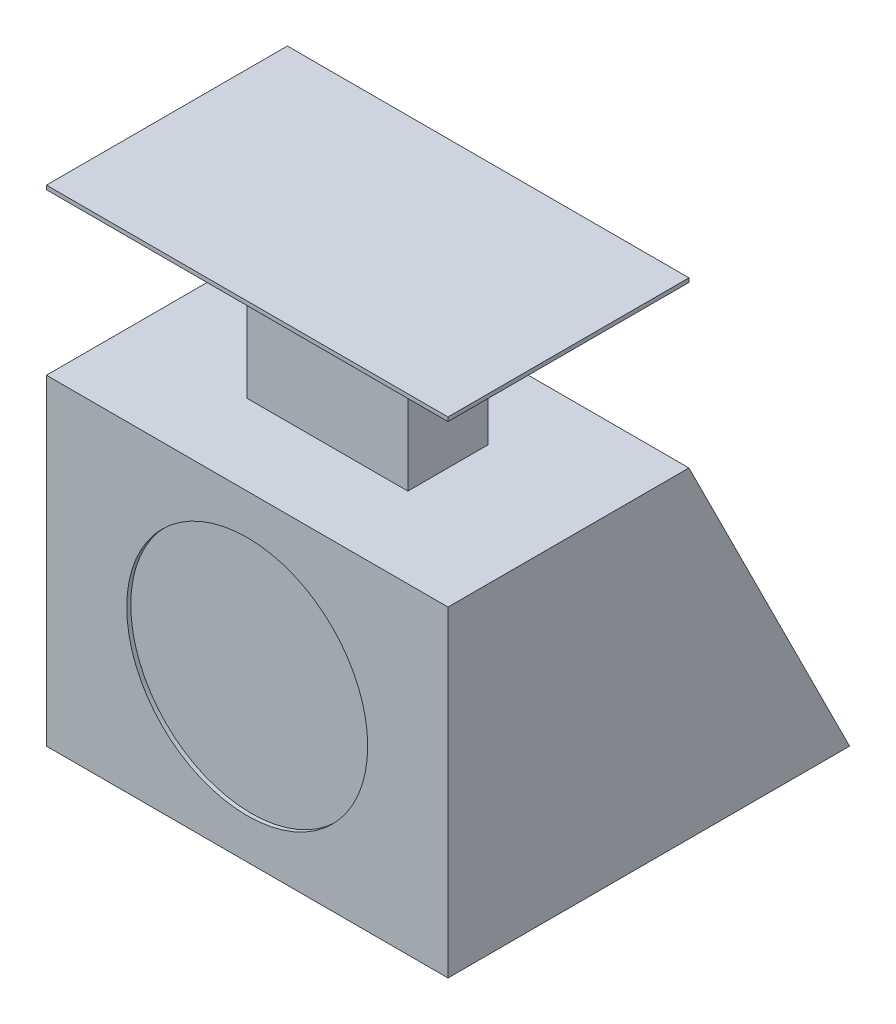
ISO-10303-21;
HEADER;
FILE_DESCRIPTION(('STEP AP214'),'2;1');
FILE_NAME('part.step','',(''),(''),'','','');
FILE_SCHEMA(('AUTOMOTIVE_DESIGN { 1 0 10303 214 1 1 1 1 }'));
ENDSEC;
DATA;
#1=APPLICATION_CONTEXT('core data for automotive mechanical design processes');
#2=APPLICATION_PROTOCOL_DEFINITION('international standard','automotive_design',2000,#1);
#3=PRODUCT_CONTEXT('',#1,'mechanical');
#4=PRODUCT('Part','Part','',(#3));
#5=PRODUCT_RELATED_PRODUCT_CATEGORY('part','',(#4));
#6=PRODUCT_DEFINITION_FORMATION('','',#4);
#7=PRODUCT_DEFINITION_CONTEXT('part definition',#1,'design');
#8=PRODUCT_DEFINITION('design','',#6,#7);
#9=PRODUCT_DEFINITION_SHAPE('','',#8);
#10=(LENGTH_UNIT() NAMED_UNIT(*) SI_UNIT(.MILLI.,.METRE.));
#11=(NAMED_UNIT(*) PLANE_ANGLE_UNIT() SI_UNIT($,.RADIAN.));
#12=(NAMED_UNIT(*) SI_UNIT($,.STERADIAN.) SOLID_ANGLE_UNIT());
#13=UNCERTAINTY_MEASURE_WITH_UNIT(LENGTH_MEASURE(1.E-05),#10,'distance_accuracy_value','');
#14=(GEOMETRIC_REPRESENTATION_CONTEXT(3) GLOBAL_UNCERTAINTY_ASSIGNED_CONTEXT((#13)) GLOBAL_UNIT_ASSIGNED_CONTEXT((#10,
#11,#12)) REPRESENTATION_CONTEXT('',''));
#15=CARTESIAN_POINT('',(0.,0.,0.));
#16=DIRECTION('',(0.,0.,1.));
#17=DIRECTION('',(1.,0.,0.));
#18=AXIS2_PLACEMENT_3D('',#15,#16,#17);
#19=CARTESIAN_POINT('',(100.,80.,0.));
#20=DIRECTION('',(0.,-1.,0.));
#21=DIRECTION('',(0.,0.,-1.));
#22=AXIS2_PLACEMENT_3D('',#19,#20,#21);
#23=PLANE('',#22);
#24=DIRECTION('',(0.,0.,1.));
#25=VECTOR('',#24,1.);
#26=CARTESIAN_POINT('',(0.,80.,0.));
#27=LINE('',#26,#25);
#28=CARTESIAN_POINT('',(0.,80.,-60.));
#29=VERTEX_POINT('',#28);
#30=CARTESIAN_POINT('',(0.,80.,0.));
#31=VERTEX_POINT('',#30);
#32=EDGE_CURVE('E199',#29,#31,#27,.T.);
#33=ORIENTED_EDGE('',*,*,#32,.T.);
#34=DIRECTION('',(-1.,0.,0.));
#35=VECTOR('',#34,1.);
#36=CARTESIAN_POINT('',(100.,80.,0.));
#37=LINE('',#36,#35);
#38=CARTESIAN_POINT('',(100.,80.,0.));
#39=VERTEX_POINT('',#38);
#40=EDGE_CURVE('E38',#39,#31,#37,.T.);
#41=ORIENTED_EDGE('',*,*,#40,.F.);
#42=DIRECTION('',(0.,0.,1.));
#43=VECTOR('',#42,1.);
#44=CARTESIAN_POINT('',(100.,80.,0.));
#45=LINE('',#44,#43);
#46=CARTESIAN_POINT('',(100.,80.,-60.));
#47=VERTEX_POINT('',#46);
#48=EDGE_CURVE('E208',#47,#39,#45,.T.);
#49=ORIENTED_EDGE('',*,*,#48,.F.);
#50=DIRECTION('',(-1.,0.,0.));
#51=VECTOR('',#50,1.);
#52=CARTESIAN_POINT('',(100.,80.,-60.));
#53=LINE('',#52,#51);
#54=EDGE_CURVE('E11',#47,#29,#53,.T.);
#55=ORIENTED_EDGE('',*,*,#54,.T.);
#56=EDGE_LOOP('',(#33,#41,#49,#55));
#57=FACE_BOUND('',#56,.T.);
#58=DIRECTION('',(0.,0.,1.));
#59=VECTOR('',#58,1.);
#60=CARTESIAN_POINT('',(30.,80.,-20.));
#61=LINE('',#60,#59);
#62=CARTESIAN_POINT('',(30.,80.,-40.));
#63=VERTEX_POINT('',#62);
#64=CARTESIAN_POINT('',(30.,80.,-20.));
#65=VERTEX_POINT('',#64);
#66=EDGE_CURVE('E136',#63,#65,#61,.T.);
#67=ORIENTED_EDGE('',*,*,#66,.F.);
#68=DIRECTION('',(-1.,0.,0.));
#69=VECTOR('',#68,1.);
#70=CARTESIAN_POINT('',(30.,80.,-40.));
#71=LINE('',#70,#69);
#72=CARTESIAN_POINT('',(70.,80.,-40.));
#73=VERTEX_POINT('',#72);
#74=EDGE_CURVE('E164',#73,#63,#71,.T.);
#75=ORIENTED_EDGE('',*,*,#74,.F.);
#76=DIRECTION('',(0.,0.,-1.));
#77=VECTOR('',#76,1.);
#78=CARTESIAN_POINT('',(70.,80.,-20.));
#79=LINE('',#78,#77);
#80=CARTESIAN_POINT('',(70.,80.,-20.));
#81=VERTEX_POINT('',#80);
#82=EDGE_CURVE('E50',#81,#73,#79,.T.);
#83=ORIENTED_EDGE('',*,*,#82,.F.);
#84=DIRECTION('',(1.,0.,0.));
#85=VECTOR('',#84,1.);
#86=CARTESIAN_POINT('',(30.,80.,-20.));
#87=LINE('',#86,#85);
#88=EDGE_CURVE('E45',#65,#81,#87,.T.);
#89=ORIENTED_EDGE('',*,*,#88,.F.);
#90=EDGE_LOOP('',(#67,#75,#83,#89));
#91=FACE_BOUND('',#90,.T.);
#92=ADVANCED_FACE('F30',(#57,#91),#23,.F.);
#93=CARTESIAN_POINT('',(100.,80.,-60.));
#94=DIRECTION('',(0.,-0.447213595499958,0.894427190999916));
#95=DIRECTION('',(0.,-0.894427190999916,-0.447213595499958));
#96=AXIS2_PLACEMENT_3D('',#93,#94,#95);
#97=PLANE('',#96);
#98=DIRECTION('',(0.,0.894427190999916,0.447213595499958));
#99=VECTOR('',#98,1.);
#100=CARTESIAN_POINT('',(0.,80.,-60.));
#101=LINE('',#100,#99);
#102=CARTESIAN_POINT('',(0.,0.,-100.));
#103=VERTEX_POINT('',#102);
#104=EDGE_CURVE('E196',#103,#29,#101,.T.);
#105=ORIENTED_EDGE('',*,*,#104,.T.);
#106=ORIENTED_EDGE('',*,*,#54,.F.);
#107=DIRECTION('',(0.,0.894427190999916,0.447213595499958));
#108=VECTOR('',#107,1.);
#109=CARTESIAN_POINT('',(100.,80.,-60.));
#110=LINE('',#109,#108);
#111=CARTESIAN_POINT('',(100.,0.,-100.));
#112=VERTEX_POINT('',#111);
#113=EDGE_CURVE('E205',#112,#47,#110,.T.);
#114=ORIENTED_EDGE('',*,*,#113,.F.);
#115=DIRECTION('',(-1.,0.,0.));
#116=VECTOR('',#115,1.);
#117=CARTESIAN_POINT('',(100.,0.,-100.));
#118=LINE('',#117,#116);
#119=EDGE_CURVE('E214',#112,#103,#118,.T.);
#120=ORIENTED_EDGE('',*,*,#119,.T.);
#121=EDGE_LOOP('',(#105,#106,#114,#120));
#122=FACE_BOUND('',#121,.T.);
#123=ADVANCED_FACE('F32',(#122),#97,.F.);
#124=CARTESIAN_POINT('',(100.,0.,0.));
#125=DIRECTION('',(0.,0.,-1.));
#126=DIRECTION('',(-1.,0.,0.));
#127=AXIS2_PLACEMENT_3D('',#124,#125,#126);
#128=PLANE('',#127);
#129=CARTESIAN_POINT('',(50.,40.,0.));
#130=DIRECTION('',(0.,0.,1.));
#131=DIRECTION('',(1.,0.,0.));
#132=AXIS2_PLACEMENT_3D('',#129,#130,#131);
#133=CIRCLE('',#132,30.);
#134=CARTESIAN_POINT('',(80.,40.,0.));
#135=VERTEX_POINT('',#134);
#136=EDGE_CURVE('E190',#135,#135,#133,.T.);
#137=ORIENTED_EDGE('',*,*,#136,.F.);
#138=EDGE_LOOP('',(#137));
#139=FACE_BOUND('',#138,.T.);
#140=DIRECTION('',(0.,-1.,0.));
#141=VECTOR('',#140,1.);
#142=CARTESIAN_POINT('',(0.,0.,0.));
#143=LINE('',#142,#141);
#144=CARTESIAN_POINT('',(0.,0.,0.));
#145=VERTEX_POINT('',#144);
#146=EDGE_CURVE('E201',#31,#145,#143,.T.);
#147=ORIENTED_EDGE('',*,*,#146,.T.);
#148=DIRECTION('',(-1.,0.,0.));
#149=VECTOR('',#148,1.);
#150=CARTESIAN_POINT('',(100.,0.,0.));
#151=LINE('',#150,#149);
#152=CARTESIAN_POINT('',(100.,0.,0.));
#153=VERTEX_POINT('',#152);
#154=EDGE_CURVE('E217',#153,#145,#151,.T.);
#155=ORIENTED_EDGE('',*,*,#154,.F.);
#156=DIRECTION('',(0.,-1.,0.));
#157=VECTOR('',#156,1.);
#158=CARTESIAN_POINT('',(100.,0.,0.));
#159=LINE('',#158,#157);
#160=EDGE_CURVE('E210',#39,#153,#159,.T.);
#161=ORIENTED_EDGE('',*,*,#160,.F.);
#162=ORIENTED_EDGE('',*,*,#40,.T.);
#163=EDGE_LOOP('',(#147,#155,#161,#162));
#164=FACE_BOUND('',#163,.T.);
#165=ADVANCED_FACE('F224',(#139,#164),#128,.F.);
#166=CARTESIAN_POINT('',(100.,0.,-100.));
#167=DIRECTION('',(0.,1.,0.));
#168=DIRECTION('',(0.,0.,1.));
#169=AXIS2_PLACEMENT_3D('',#166,#167,#168);
#170=PLANE('',#169);
#171=DIRECTION('',(0.,0.,-1.));
#172=VECTOR('',#171,1.);
#173=CARTESIAN_POINT('',(0.,0.,-100.));
#174=LINE('',#173,#172);
#175=EDGE_CURVE('E203',#145,#103,#174,.T.);
#176=ORIENTED_EDGE('',*,*,#175,.T.);
#177=ORIENTED_EDGE('',*,*,#119,.F.);
#178=DIRECTION('',(0.,0.,-1.));
#179=VECTOR('',#178,1.);
#180=CARTESIAN_POINT('',(100.,0.,-100.));
#181=LINE('',#180,#179);
#182=EDGE_CURVE('E212',#153,#112,#181,.T.);
#183=ORIENTED_EDGE('',*,*,#182,.F.);
#184=ORIENTED_EDGE('',*,*,#154,.T.);
#185=EDGE_LOOP('',(#176,#177,#183,#184));
#186=FACE_BOUND('',#185,.T.);
#187=ADVANCED_FACE('F233',(#186),#170,.F.);
#188=CARTESIAN_POINT('',(100.,0.,-100.));
#189=DIRECTION('',(-1.,0.,0.));
#190=DIRECTION('',(0.,0.,1.));
#191=AXIS2_PLACEMENT_3D('',#188,#189,#190);
#192=PLANE('',#191);
#193=ORIENTED_EDGE('',*,*,#113,.T.);
#194=ORIENTED_EDGE('',*,*,#48,.T.);
#195=ORIENTED_EDGE('',*,*,#160,.T.);
#196=ORIENTED_EDGE('',*,*,#182,.T.);
#197=EDGE_LOOP('',(#193,#194,#195,#196));
#198=FACE_BOUND('',#197,.T.);
#199=ADVANCED_FACE('F239',(#198),#192,.F.);
#200=CARTESIAN_POINT('',(0.,0.,-100.));
#201=DIRECTION('',(-1.,0.,0.));
#202=DIRECTION('',(0.,0.,1.));
#203=AXIS2_PLACEMENT_3D('',#200,#201,#202);
#204=PLANE('',#203);
#205=ORIENTED_EDGE('',*,*,#104,.F.);
#206=ORIENTED_EDGE('',*,*,#175,.F.);
#207=ORIENTED_EDGE('',*,*,#146,.F.);
#208=ORIENTED_EDGE('',*,*,#32,.F.);
#209=EDGE_LOOP('',(#205,#206,#207,#208));
#210=FACE_BOUND('',#209,.T.);
#211=ADVANCED_FACE('F230',(#210),#204,.T.);
#212=CARTESIAN_POINT('',(50.,40.,-1.));
#213=DIRECTION('',(0.,0.,1.));
#214=DIRECTION('',(1.,0.,0.));
#215=AXIS2_PLACEMENT_3D('',#212,#213,#214);
#216=CYLINDRICAL_SURFACE('',#215,30.);
#217=CARTESIAN_POINT('',(50.,40.,-1.));
#218=DIRECTION('',(0.,0.,1.));
#219=DIRECTION('',(1.,0.,0.));
#220=AXIS2_PLACEMENT_3D('',#217,#218,#219);
#221=CIRCLE('',#220,30.);
#222=CARTESIAN_POINT('',(80.,40.,-1.));
#223=VERTEX_POINT('',#222);
#224=EDGE_CURVE('E193',#223,#223,#221,.T.);
#225=ORIENTED_EDGE('',*,*,#224,.F.);
#226=EDGE_LOOP('',(#225));
#227=FACE_BOUND('',#226,.T.);
#228=ORIENTED_EDGE('',*,*,#136,.T.);
#229=EDGE_LOOP('',(#228));
#230=FACE_BOUND('',#229,.T.);
#231=ADVANCED_FACE('F266',(#227,#230),#216,.F.);
#232=CARTESIAN_POINT('',(50.,40.,-1.));
#233=DIRECTION('',(0.,0.,1.));
#234=DIRECTION('',(1.,0.,0.));
#235=AXIS2_PLACEMENT_3D('',#232,#233,#234);
#236=PLANE('',#235);
#237=ORIENTED_EDGE('',*,*,#224,.T.);
#238=EDGE_LOOP('',(#237));
#239=FACE_BOUND('',#238,.T.);
#240=ADVANCED_FACE('F260',(#239),#236,.T.);
#241=CARTESIAN_POINT('',(30.,120.,-20.));
#242=DIRECTION('',(1.,0.,0.));
#243=DIRECTION('',(0.,0.,-1.));
#244=AXIS2_PLACEMENT_3D('',#241,#242,#243);
#245=PLANE('',#244);
#246=ORIENTED_EDGE('',*,*,#66,.T.);
#247=DIRECTION('',(0.,-1.,0.));
#248=VECTOR('',#247,1.);
#249=CARTESIAN_POINT('',(30.,120.,-20.));
#250=LINE('',#249,#248);
#251=CARTESIAN_POINT('',(30.,120.,-20.));
#252=VERTEX_POINT('',#251);
#253=EDGE_CURVE('E188',#252,#65,#250,.T.);
#254=ORIENTED_EDGE('',*,*,#253,.F.);
#255=DIRECTION('',(0.,0.,1.));
#256=VECTOR('',#255,1.);
#257=CARTESIAN_POINT('',(30.,120.,-20.));
#258=LINE('',#257,#256);
#259=CARTESIAN_POINT('',(30.,120.,-40.));
#260=VERTEX_POINT('',#259);
#261=EDGE_CURVE('E167',#260,#252,#258,.T.);
#262=ORIENTED_EDGE('',*,*,#261,.F.);
#263=DIRECTION('',(0.,-1.,0.));
#264=VECTOR('',#263,1.);
#265=CARTESIAN_POINT('',(30.,120.,-40.));
#266=LINE('',#265,#264);
#267=EDGE_CURVE('E179',#260,#63,#266,.T.);
#268=ORIENTED_EDGE('',*,*,#267,.T.);
#269=EDGE_LOOP('',(#246,#254,#262,#268));
#270=FACE_BOUND('',#269,.T.);
#271=ADVANCED_FACE('F247',(#270),#245,.F.);
#272=CARTESIAN_POINT('',(30.,120.,-20.));
#273=DIRECTION('',(0.,0.,-1.));
#274=DIRECTION('',(-1.,0.,0.));
#275=AXIS2_PLACEMENT_3D('',#272,#273,#274);
#276=PLANE('',#275);
#277=ORIENTED_EDGE('',*,*,#88,.T.);
#278=DIRECTION('',(0.,-1.,0.));
#279=VECTOR('',#278,1.);
#280=CARTESIAN_POINT('',(70.,120.,-20.));
#281=LINE('',#280,#279);
#282=CARTESIAN_POINT('',(70.,120.,-20.));
#283=VERTEX_POINT('',#282);
#284=EDGE_CURVE('E185',#283,#81,#281,.T.);
#285=ORIENTED_EDGE('',*,*,#284,.F.);
#286=DIRECTION('',(1.,0.,0.));
#287=VECTOR('',#286,1.);
#288=CARTESIAN_POINT('',(30.,120.,-20.));
#289=LINE('',#288,#287);
#290=EDGE_CURVE('E170',#252,#283,#289,.T.);
#291=ORIENTED_EDGE('',*,*,#290,.F.);
#292=ORIENTED_EDGE('',*,*,#253,.T.);
#293=EDGE_LOOP('',(#277,#285,#291,#292));
#294=FACE_BOUND('',#293,.T.);
#295=ADVANCED_FACE('F252',(#294),#276,.F.);
#296=CARTESIAN_POINT('',(70.,120.,-20.));
#297=DIRECTION('',(-1.,0.,0.));
#298=DIRECTION('',(0.,0.,1.));
#299=AXIS2_PLACEMENT_3D('',#296,#297,#298);
#300=PLANE('',#299);
#301=ORIENTED_EDGE('',*,*,#82,.T.);
#302=DIRECTION('',(0.,-1.,0.));
#303=VECTOR('',#302,1.);
#304=CARTESIAN_POINT('',(70.,120.,-40.));
#305=LINE('',#304,#303);
#306=CARTESIAN_POINT('',(70.,120.,-40.));
#307=VERTEX_POINT('',#306);
#308=EDGE_CURVE('E182',#307,#73,#305,.T.);
#309=ORIENTED_EDGE('',*,*,#308,.F.);
#310=DIRECTION('',(0.,0.,-1.));
#311=VECTOR('',#310,1.);
#312=CARTESIAN_POINT('',(70.,120.,-20.));
#313=LINE('',#312,#311);
#314=EDGE_CURVE('E173',#283,#307,#313,.T.);
#315=ORIENTED_EDGE('',*,*,#314,.F.);
#316=ORIENTED_EDGE('',*,*,#284,.T.);
#317=EDGE_LOOP('',(#301,#309,#315,#316));
#318=FACE_BOUND('',#317,.T.);
#319=ADVANCED_FACE('F250',(#318),#300,.F.);
#320=CARTESIAN_POINT('',(30.,120.,-40.));
#321=DIRECTION('',(0.,0.,1.));
#322=DIRECTION('',(1.,0.,0.));
#323=AXIS2_PLACEMENT_3D('',#320,#321,#322);
#324=PLANE('',#323);
#325=ORIENTED_EDGE('',*,*,#74,.T.);
#326=ORIENTED_EDGE('',*,*,#267,.F.);
#327=DIRECTION('',(-1.,0.,0.));
#328=VECTOR('',#327,1.);
#329=CARTESIAN_POINT('',(30.,120.,-40.));
#330=LINE('',#329,#328);
#331=EDGE_CURVE('E176',#307,#260,#330,.T.);
#332=ORIENTED_EDGE('',*,*,#331,.F.);
#333=ORIENTED_EDGE('',*,*,#308,.T.);
#334=EDGE_LOOP('',(#325,#326,#332,#333));
#335=FACE_BOUND('',#334,.T.);
#336=ADVANCED_FACE('F245',(#335),#324,.F.);
#337=CARTESIAN_POINT('',(100.,120.,-60.));
#338=DIRECTION('',(0.,1.,0.));
#339=DIRECTION('',(0.,0.,1.));
#340=AXIS2_PLACEMENT_3D('',#337,#338,#339);
#341=PLANE('',#340);
#342=DIRECTION('',(0.,0.,-1.));
#343=VECTOR('',#342,1.);
#344=CARTESIAN_POINT('',(100.,120.,0.));
#345=LINE('',#344,#343);
#346=CARTESIAN_POINT('',(100.,120.,0.));
#347=VERTEX_POINT('',#346);
#348=CARTESIAN_POINT('',(100.,120.,-60.));
#349=VERTEX_POINT('',#348);
#350=EDGE_CURVE('E123',#347,#349,#345,.T.);
#351=ORIENTED_EDGE('',*,*,#350,.F.);
#352=DIRECTION('',(1.,0.,0.));
#353=VECTOR('',#352,1.);
#354=CARTESIAN_POINT('',(100.,120.,0.));
#355=LINE('',#354,#353);
#356=CARTESIAN_POINT('',(0.,120.,0.));
#357=VERTEX_POINT('',#356);
#358=EDGE_CURVE('E146',#357,#347,#355,.T.);
#359=ORIENTED_EDGE('',*,*,#358,.F.);
#360=DIRECTION('',(0.,0.,1.));
#361=VECTOR('',#360,1.);
#362=CARTESIAN_POINT('',(0.,120.,0.));
#363=LINE('',#362,#361);
#364=CARTESIAN_POINT('',(0.,120.,-60.));
#365=VERTEX_POINT('',#364);
#366=EDGE_CURVE('E124',#365,#357,#363,.T.);
#367=ORIENTED_EDGE('',*,*,#366,.F.);
#368=DIRECTION('',(-1.,0.,0.));
#369=VECTOR('',#368,1.);
#370=CARTESIAN_POINT('',(100.,120.,-60.));
#371=LINE('',#370,#369);
#372=EDGE_CURVE('E117',#349,#365,#371,.T.);
#373=ORIENTED_EDGE('',*,*,#372,.F.);
#374=EDGE_LOOP('',(#351,#359,#367,#373));
#375=FACE_BOUND('',#374,.T.);
#376=ORIENTED_EDGE('',*,*,#331,.T.);
#377=ORIENTED_EDGE('',*,*,#261,.T.);
#378=ORIENTED_EDGE('',*,*,#290,.T.);
#379=ORIENTED_EDGE('',*,*,#314,.T.);
#380=EDGE_LOOP('',(#376,#377,#378,#379));
#381=FACE_BOUND('',#380,.T.);
#382=ADVANCED_FACE('F119',(#375,#381),#341,.F.);
#383=CARTESIAN_POINT('',(100.,121.,0.));
#384=DIRECTION('',(-1.,0.,0.));
#385=DIRECTION('',(0.,0.,1.));
#386=AXIS2_PLACEMENT_3D('',#383,#384,#385);
#387=PLANE('',#386);
#388=ORIENTED_EDGE('',*,*,#350,.T.);
#389=DIRECTION('',(0.,-1.,0.));
#390=VECTOR('',#389,1.);
#391=CARTESIAN_POINT('',(100.,121.,-60.));
#392=LINE('',#391,#390);
#393=CARTESIAN_POINT('',(100.,121.,-60.));
#394=VERTEX_POINT('',#393);
#395=EDGE_CURVE('E130',#394,#349,#392,.T.);
#396=ORIENTED_EDGE('',*,*,#395,.F.);
#397=DIRECTION('',(0.,0.,-1.));
#398=VECTOR('',#397,1.);
#399=CARTESIAN_POINT('',(100.,121.,0.));
#400=LINE('',#399,#398);
#401=CARTESIAN_POINT('',(100.,121.,0.));
#402=VERTEX_POINT('',#401);
#403=EDGE_CURVE('E148',#402,#394,#400,.T.);
#404=ORIENTED_EDGE('',*,*,#403,.F.);
#405=DIRECTION('',(0.,-1.,0.));
#406=VECTOR('',#405,1.);
#407=CARTESIAN_POINT('',(100.,121.,0.));
#408=LINE('',#407,#406);
#409=EDGE_CURVE('E142',#402,#347,#408,.T.);
#410=ORIENTED_EDGE('',*,*,#409,.T.);
#411=EDGE_LOOP('',(#388,#396,#404,#410));
#412=FACE_BOUND('',#411,.T.);
#413=ADVANCED_FACE('F140',(#412),#387,.F.);
#414=CARTESIAN_POINT('',(100.,121.,-60.));
#415=DIRECTION('',(0.,0.,1.));
#416=DIRECTION('',(1.,0.,0.));
#417=AXIS2_PLACEMENT_3D('',#414,#415,#416);
#418=PLANE('',#417);
#419=ORIENTED_EDGE('',*,*,#372,.T.);
#420=DIRECTION('',(0.,-1.,0.));
#421=VECTOR('',#420,1.);
#422=CARTESIAN_POINT('',(0.,121.,-60.));
#423=LINE('',#422,#421);
#424=CARTESIAN_POINT('',(0.,121.,-60.));
#425=VERTEX_POINT('',#424);
#426=EDGE_CURVE('E137',#425,#365,#423,.T.);
#427=ORIENTED_EDGE('',*,*,#426,.F.);
#428=DIRECTION('',(-1.,0.,0.));
#429=VECTOR('',#428,1.);
#430=CARTESIAN_POINT('',(100.,121.,-60.));
#431=LINE('',#430,#429);
#432=EDGE_CURVE('E132',#394,#425,#431,.T.);
#433=ORIENTED_EDGE('',*,*,#432,.F.);
#434=ORIENTED_EDGE('',*,*,#395,.T.);
#435=EDGE_LOOP('',(#419,#427,#433,#434));
#436=FACE_BOUND('',#435,.T.);
#437=ADVANCED_FACE('F131',(#436),#418,.F.);
#438=CARTESIAN_POINT('',(0.,121.,0.));
#439=DIRECTION('',(1.,0.,0.));
#440=DIRECTION('',(0.,0.,-1.));
#441=AXIS2_PLACEMENT_3D('',#438,#439,#440);
#442=PLANE('',#441);
#443=ORIENTED_EDGE('',*,*,#366,.T.);
#444=DIRECTION('',(0.,-1.,0.));
#445=VECTOR('',#444,1.);
#446=CARTESIAN_POINT('',(0.,121.,0.));
#447=LINE('',#446,#445);
#448=CARTESIAN_POINT('',(0.,121.,0.));
#449=VERTEX_POINT('',#448);
#450=EDGE_CURVE('E156',#449,#357,#447,.T.);
#451=ORIENTED_EDGE('',*,*,#450,.F.);
#452=DIRECTION('',(0.,0.,1.));
#453=VECTOR('',#452,1.);
#454=CARTESIAN_POINT('',(0.,121.,0.));
#455=LINE('',#454,#453);
#456=EDGE_CURVE('E151',#425,#449,#455,.T.);
#457=ORIENTED_EDGE('',*,*,#456,.F.);
#458=ORIENTED_EDGE('',*,*,#426,.T.);
#459=EDGE_LOOP('',(#443,#451,#457,#458));
#460=FACE_BOUND('',#459,.T.);
#461=ADVANCED_FACE('F343',(#460),#442,.F.);
#462=CARTESIAN_POINT('',(100.,121.,0.));
#463=DIRECTION('',(0.,0.,-1.));
#464=DIRECTION('',(-1.,0.,0.));
#465=AXIS2_PLACEMENT_3D('',#462,#463,#464);
#466=PLANE('',#465);
#467=ORIENTED_EDGE('',*,*,#358,.T.);
#468=ORIENTED_EDGE('',*,*,#409,.F.);
#469=DIRECTION('',(1.,0.,0.));
#470=VECTOR('',#469,1.);
#471=CARTESIAN_POINT('',(100.,121.,0.));
#472=LINE('',#471,#470);
#473=EDGE_CURVE('E153',#449,#402,#472,.T.);
#474=ORIENTED_EDGE('',*,*,#473,.F.);
#475=ORIENTED_EDGE('',*,*,#450,.T.);
#476=EDGE_LOOP('',(#467,#468,#474,#475));
#477=FACE_BOUND('',#476,.T.);
#478=ADVANCED_FACE('F352',(#477),#466,.F.);
#479=CARTESIAN_POINT('',(100.,121.,-60.));
#480=DIRECTION('',(0.,1.,0.));
#481=DIRECTION('',(0.,0.,1.));
#482=AXIS2_PLACEMENT_3D('',#479,#480,#481);
#483=PLANE('',#482);
#484=ORIENTED_EDGE('',*,*,#403,.T.);
#485=ORIENTED_EDGE('',*,*,#432,.T.);
#486=ORIENTED_EDGE('',*,*,#456,.T.);
#487=ORIENTED_EDGE('',*,*,#473,.T.);
#488=EDGE_LOOP('',(#484,#485,#486,#487));
#489=FACE_BOUND('',#488,.T.);
#490=ADVANCED_FACE('F362',(#489),#483,.T.);
#491=CLOSED_SHELL('',(#92,#123,#165,#187,#199,#211,#231,#240,#271,#295,#319,#336,#382,#413,#437,
#461,#478,#490));
#492=MANIFOLD_SOLID_BREP('B2',#491);
#493=ADVANCED_BREP_SHAPE_REPRESENTATION('',(#18,#492),#14);
#494=SHAPE_DEFINITION_REPRESENTATION(#9,#493);
ENDSEC;
END-ISO-10303-21;
